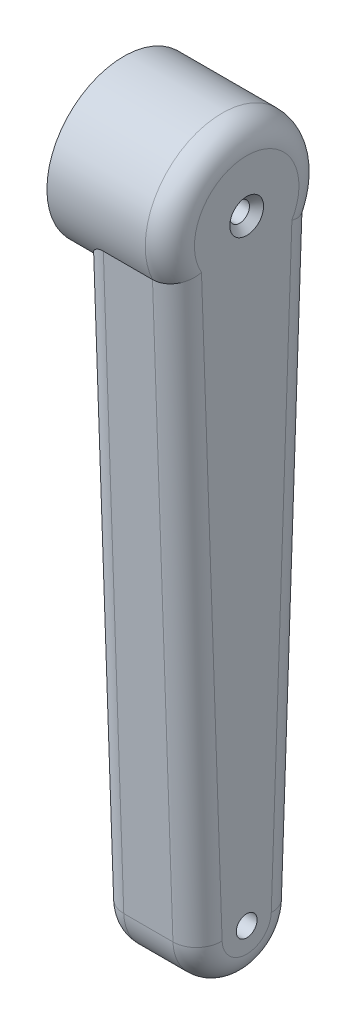
ISO-10303-21;
HEADER;
FILE_DESCRIPTION(('STEP AP214'),'2;1');
FILE_NAME('part.step','',(''),(''),'','','');
FILE_SCHEMA(('AUTOMOTIVE_DESIGN { 1 0 10303 214 1 1 1 1 }'));
ENDSEC;
DATA;
#1=APPLICATION_CONTEXT('core data for automotive mechanical design processes');
#2=APPLICATION_PROTOCOL_DEFINITION('international standard','automotive_design',2000,#1);
#3=PRODUCT_CONTEXT('',#1,'mechanical');
#4=PRODUCT('Part','Part','',(#3));
#5=PRODUCT_RELATED_PRODUCT_CATEGORY('part','',(#4));
#6=PRODUCT_DEFINITION_FORMATION('','',#4);
#7=PRODUCT_DEFINITION_CONTEXT('part definition',#1,'design');
#8=PRODUCT_DEFINITION('design','',#6,#7);
#9=PRODUCT_DEFINITION_SHAPE('','',#8);
#10=(LENGTH_UNIT() NAMED_UNIT(*) SI_UNIT(.MILLI.,.METRE.));
#11=(NAMED_UNIT(*) PLANE_ANGLE_UNIT() SI_UNIT($,.RADIAN.));
#12=(NAMED_UNIT(*) SI_UNIT($,.STERADIAN.) SOLID_ANGLE_UNIT());
#13=UNCERTAINTY_MEASURE_WITH_UNIT(LENGTH_MEASURE(1.E-05),#10,'distance_accuracy_value','');
#14=(GEOMETRIC_REPRESENTATION_CONTEXT(3) GLOBAL_UNCERTAINTY_ASSIGNED_CONTEXT((#13)) GLOBAL_UNIT_ASSIGNED_CONTEXT((#10,
#11,#12)) REPRESENTATION_CONTEXT('',''));
#15=CARTESIAN_POINT('',(0.,0.,0.));
#16=DIRECTION('',(0.,0.,1.));
#17=DIRECTION('',(1.,0.,0.));
#18=AXIS2_PLACEMENT_3D('',#15,#16,#17);
#19=CARTESIAN_POINT('',(16.,-100.,0.));
#20=DIRECTION('',(-1.,0.,0.));
#21=DIRECTION('',(0.,0.,1.));
#22=AXIS2_PLACEMENT_3D('',#19,#20,#21);
#23=PLANE('',#22);
#24=CARTESIAN_POINT('',(16.,0.,0.));
#25=DIRECTION('',(-1.,0.,0.));
#26=DIRECTION('',(0.,0.,1.));
#27=AXIS2_PLACEMENT_3D('',#24,#25,#26);
#28=CIRCLE('',#27,8.5);
#29=CARTESIAN_POINT('',(16.,-4.26004924922759,-7.35540484230171));
#30=VERTEX_POINT('',#29);
#31=CARTESIAN_POINT('',(16.,-4.26004924922762,7.35540484230169));
#32=VERTEX_POINT('',#31);
#33=EDGE_CURVE('E145',#30,#32,#28,.F.);
#34=ORIENTED_EDGE('',*,*,#33,.T.);
#35=DIRECTION('',(0.,0.999387312306895,0.0349999999999999));
#36=VECTOR('',#35,1.);
#37=CARTESIAN_POINT('',(16.,-100.14,3.99754924922757));
#38=LINE('',#37,#36);
#39=CARTESIAN_POINT('',(16.,-100.14,3.99754924922757));
#40=VERTEX_POINT('',#39);
#41=EDGE_CURVE('E149',#32,#40,#38,.F.);
#42=ORIENTED_EDGE('',*,*,#41,.T.);
#43=CARTESIAN_POINT('',(16.,-100.,0.));
#44=DIRECTION('',(-1.,0.,0.));
#45=DIRECTION('',(0.,0.,1.));
#46=AXIS2_PLACEMENT_3D('',#43,#44,#45);
#47=CIRCLE('',#46,4.);
#48=CARTESIAN_POINT('',(16.,-100.14,-3.99754924922759));
#49=VERTEX_POINT('',#48);
#50=EDGE_CURVE('E147',#40,#49,#47,.F.);
#51=ORIENTED_EDGE('',*,*,#50,.T.);
#52=DIRECTION('',(0.,-0.999387312306895,0.0349999999999999));
#53=VECTOR('',#52,1.);
#54=CARTESIAN_POINT('',(16.,-5.15847794112679,-7.32394056030689));
#55=LINE('',#54,#53);
#56=EDGE_CURVE('E143',#49,#30,#55,.F.);
#57=ORIENTED_EDGE('',*,*,#56,.T.);
#58=EDGE_LOOP('',(#34,#42,#51,#57));
#59=FACE_BOUND('',#58,.T.);
#60=CARTESIAN_POINT('',(16.,-100.,0.));
#61=DIRECTION('',(1.,0.,0.));
#62=DIRECTION('',(0.,0.,-1.));
#63=AXIS2_PLACEMENT_3D('',#60,#61,#62);
#64=CIRCLE('',#63,1.69999999999999);
#65=CARTESIAN_POINT('',(16.,-100.,-1.70000000000001));
#66=VERTEX_POINT('',#65);
#67=EDGE_CURVE('E217',#66,#66,#64,.T.);
#68=ORIENTED_EDGE('',*,*,#67,.F.);
#69=EDGE_LOOP('',(#68));
#70=FACE_BOUND('',#69,.T.);
#71=CARTESIAN_POINT('',(16.,0.,0.));
#72=DIRECTION('',(1.,0.,0.));
#73=DIRECTION('',(0.,0.,-1.));
#74=AXIS2_PLACEMENT_3D('',#71,#72,#73);
#75=CIRCLE('',#74,2.75);
#76=CARTESIAN_POINT('',(16.,0.,-2.75));
#77=VERTEX_POINT('',#76);
#78=EDGE_CURVE('E244',#77,#77,#75,.T.);
#79=ORIENTED_EDGE('',*,*,#78,.F.);
#80=EDGE_LOOP('',(#79));
#81=FACE_BOUND('',#80,.T.);
#82=ADVANCED_FACE('F39',(#59,#70,#81),#23,.F.);
#83=CARTESIAN_POINT('',(16.,-100.,0.));
#84=DIRECTION('',(-1.,0.,0.));
#85=DIRECTION('',(0.,0.,1.));
#86=AXIS2_PLACEMENT_3D('',#83,#84,#85);
#87=CYLINDRICAL_SURFACE('',#86,8.);
#88=DIRECTION('',(-1.,0.,0.));
#89=VECTOR('',#88,1.);
#90=CARTESIAN_POINT('',(16.,-100.28,7.99509849845515));
#91=LINE('',#90,#89);
#92=CARTESIAN_POINT('',(12.,-100.28,7.99509849845515));
#93=VERTEX_POINT('',#92);
#94=CARTESIAN_POINT('',(4.,-100.28,7.99509849845515));
#95=VERTEX_POINT('',#94);
#96=EDGE_CURVE('E229',#93,#95,#91,.T.);
#97=ORIENTED_EDGE('',*,*,#96,.T.);
#98=CARTESIAN_POINT('',(4.,-100.,0.));
#99=DIRECTION('',(-1.,0.,0.));
#100=DIRECTION('',(0.,0.,1.));
#101=AXIS2_PLACEMENT_3D('',#98,#99,#100);
#102=CIRCLE('',#101,8.);
#103=CARTESIAN_POINT('',(4.,-100.28,-7.99509849845517));
#104=VERTEX_POINT('',#103);
#105=EDGE_CURVE('E132',#95,#104,#102,.F.);
#106=ORIENTED_EDGE('',*,*,#105,.T.);
#107=DIRECTION('',(-1.,0.,0.));
#108=VECTOR('',#107,1.);
#109=CARTESIAN_POINT('',(16.,-100.28,-7.99509849845517));
#110=LINE('',#109,#108);
#111=CARTESIAN_POINT('',(12.,-100.28,-7.99509849845517));
#112=VERTEX_POINT('',#111);
#113=EDGE_CURVE('E231',#112,#104,#110,.T.);
#114=ORIENTED_EDGE('',*,*,#113,.F.);
#115=CARTESIAN_POINT('',(12.,-100.,0.));
#116=DIRECTION('',(-1.,0.,0.));
#117=DIRECTION('',(0.,0.,1.));
#118=AXIS2_PLACEMENT_3D('',#115,#116,#117);
#119=CIRCLE('',#118,8.);
#120=EDGE_CURVE('E129',#112,#93,#119,.T.);
#121=ORIENTED_EDGE('',*,*,#120,.T.);
#122=EDGE_LOOP('',(#97,#106,#114,#121));
#123=FACE_BOUND('',#122,.T.);
#124=ADVANCED_FACE('F180',(#123),#87,.T.);
#125=CARTESIAN_POINT('',(16.,-5.29847794112679,-11.3214898095345));
#126=DIRECTION('',(0.,-0.0349999999999999,-0.999387312306895));
#127=DIRECTION('',(0.,0.999387312306895,-0.0349999999999999));
#128=AXIS2_PLACEMENT_3D('',#125,#126,#127);
#129=PLANE('',#128);
#130=ORIENTED_EDGE('',*,*,#113,.T.);
#131=DIRECTION('',(0.,-0.999387312306895,0.0349999999999999));
#132=VECTOR('',#131,1.);
#133=CARTESIAN_POINT('',(4.,-5.29847794112679,-11.3214898095345));
#134=LINE('',#133,#132);
#135=CARTESIAN_POINT('',(4.,-5.29847794112679,-11.3214898095345));
#136=VERTEX_POINT('',#135);
#137=EDGE_CURVE('E56',#104,#136,#134,.F.);
#138=ORIENTED_EDGE('',*,*,#137,.T.);
#139=DIRECTION('',(-1.,0.,0.));
#140=VECTOR('',#139,1.);
#141=CARTESIAN_POINT('',(16.,-5.29847794112679,-11.3214898095345));
#142=LINE('',#141,#140);
#143=CARTESIAN_POINT('',(12.,-5.29847794112679,-11.3214898095345));
#144=VERTEX_POINT('',#143);
#145=EDGE_CURVE('E111',#144,#136,#142,.T.);
#146=ORIENTED_EDGE('',*,*,#145,.F.);
#147=DIRECTION('',(0.,-0.999387312306895,0.0349999999999999));
#148=VECTOR('',#147,1.);
#149=CARTESIAN_POINT('',(12.,-100.28,-7.99509849845517));
#150=LINE('',#149,#148);
#151=EDGE_CURVE('E152',#144,#112,#150,.T.);
#152=ORIENTED_EDGE('',*,*,#151,.T.);
#153=EDGE_LOOP('',(#130,#138,#146,#152));
#154=FACE_BOUND('',#153,.T.);
#155=ADVANCED_FACE('F174',(#154),#129,.T.);
#156=CARTESIAN_POINT('',(16.,0.,0.));
#157=DIRECTION('',(-1.,0.,0.));
#158=DIRECTION('',(0.,0.,1.));
#159=AXIS2_PLACEMENT_3D('',#156,#157,#158);
#160=CYLINDRICAL_SURFACE('',#159,12.5);
#161=DIRECTION('',(-1.,0.,0.));
#162=VECTOR('',#161,1.);
#163=CARTESIAN_POINT('',(16.,-5.29847794112683,11.3214898095344));
#164=LINE('',#163,#162);
#165=CARTESIAN_POINT('',(12.,-5.29847794112683,11.3214898095344));
#166=VERTEX_POINT('',#165);
#167=CARTESIAN_POINT('',(4.,-5.29847794112683,11.3214898095344));
#168=VERTEX_POINT('',#167);
#169=EDGE_CURVE('E234',#166,#168,#164,.T.);
#170=ORIENTED_EDGE('',*,*,#169,.F.);
#171=CARTESIAN_POINT('',(12.,0.,0.));
#172=DIRECTION('',(-1.,0.,0.));
#173=DIRECTION('',(0.,0.,1.));
#174=AXIS2_PLACEMENT_3D('',#171,#172,#173);
#175=CIRCLE('',#174,12.5);
#176=EDGE_CURVE('E63',#166,#144,#175,.T.);
#177=ORIENTED_EDGE('',*,*,#176,.T.);
#178=ORIENTED_EDGE('',*,*,#145,.T.);
#179=CARTESIAN_POINT('',(4.,-5.29847794112679,-11.3214898095345));
#180=CARTESIAN_POINT('',(3.94827259578191,-5.29844501342563,-11.321501846381));
#181=CARTESIAN_POINT('',(3.89656696703319,-5.30079572383906,-11.3204050474624));
#182=CARTESIAN_POINT('',(3.79374021031847,-5.31000629834465,-11.3160893890076));
#183=CARTESIAN_POINT('',(3.74261818628529,-5.31685790752488,-11.312874414298));
#184=CARTESIAN_POINT('',(3.6421114833302,-5.33467131226439,-11.3044845280791));
#185=CARTESIAN_POINT('',(3.59271210711949,-5.3455661135294,-11.2993415495444));
#186=CARTESIAN_POINT('',(3.495101454552,-5.37107380656171,-11.2872391753606));
#187=CARTESIAN_POINT('',(3.44689079233543,-5.3856885778325,-11.2802788614625));
#188=CARTESIAN_POINT('',(3.27191115544819,-5.44555915207527,-11.2515867315262));
#189=CARTESIAN_POINT('',(3.14941273535164,-5.50100357968462,-11.2247020487472));
#190=CARTESIAN_POINT('',(2.91472992170457,-5.6276274640149,-11.1617575003199));
#191=CARTESIAN_POINT('',(2.80263278497043,-5.69892549511647,-11.1256281664731));
#192=CARTESIAN_POINT('',(2.59338398478274,-5.84761336375433,-11.0481729323011));
#193=CARTESIAN_POINT('',(2.4957714088286,-5.92454087451836,-11.0071834909875));
#194=CARTESIAN_POINT('',(2.30801814991435,-6.0842489266541,-10.9197170545552));
#195=CARTESIAN_POINT('',(2.21788438790958,-6.16703476097216,-10.8732350709092));
#196=CARTESIAN_POINT('',(2.04398213691388,-6.33654138233907,-10.7753349434999));
#197=CARTESIAN_POINT('',(1.96022347760559,-6.42326792940482,-10.7239094430103));
#198=CARTESIAN_POINT('',(1.79844184806451,-6.59924664326761,-10.616524344237));
#199=CARTESIAN_POINT('',(1.72042067497507,-6.68849958938296,-10.5605633367448));
#200=CARTESIAN_POINT('',(1.51352406145531,-6.93550408917516,-10.401135282344));
#201=CARTESIAN_POINT('',(1.38993889182053,-7.09487467875508,-10.2932663731318));
#202=CARTESIAN_POINT('',(1.15707932408039,-7.41517626360612,-10.0649855594774));
#203=CARTESIAN_POINT('',(1.04781346429156,-7.57610812896822,-9.94456624761134));
#204=CARTESIAN_POINT('',(0.843667044363425,-7.89692695478744,-9.69175686926402));
#205=CARTESIAN_POINT('',(0.748752492750532,-8.05681549793047,-9.55939631324617));
#206=CARTESIAN_POINT('',(0.573605964047782,-8.37418229138815,-9.28263944853098));
#207=CARTESIAN_POINT('',(0.493371455039384,-8.53166095304193,-9.13824522158786));
#208=CARTESIAN_POINT('',(0.356026018541589,-8.8272223850927,-8.85257547467984));
#209=CARTESIAN_POINT('',(0.297410558210616,-8.96567915450798,-8.71241233474033));
#210=CARTESIAN_POINT('',(0.194498443726828,-9.23815982172879,-8.42293845075238));
#211=CARTESIAN_POINT('',(0.150194038588486,-9.37218608370382,-8.27363271071539));
#212=CARTESIAN_POINT('',(0.0773853409177179,-9.63533465578342,-7.96564547167313));
#213=CARTESIAN_POINT('',(0.0489586575956671,-9.764430053355,-7.80692204329362));
#214=CARTESIAN_POINT('',(0.0199378440825788,-9.95292974496337,-7.56305456559429));
#215=CARTESIAN_POINT('',(0.0125335100088522,-10.0149685992016,-7.48071156025581));
#216=CARTESIAN_POINT('',(0.00256498604680787,-10.1371430025419,-7.31430104528432));
#217=CARTESIAN_POINT('',(2.30051907135436E-06,-10.1972779543731,-7.23023300786135));
#218=CARTESIAN_POINT('',(0.,-10.256373123069,-7.14540484230172));
#219=B_SPLINE_CURVE_WITH_KNOTS('',3,(#179,#180,#181,#182,#183,#184,#185,#186,#187,#188,#189,
#190,#191,#192,#193,#194,#195,#196,#197,#198,#199,#200,#201,#202,#203,#204,#205,#206,#207,#208,
#209,#210,#211,#212,#213,#214,#215,#216,#217,#218),.UNSPECIFIED.,.F.,.F.,(4,2,2,2,2,2,2,2,2,2,2,
2,2,2,2,2,2,2,2,4),(0.,0.155082242006115,0.309880845245904,0.46222136348192,0.614639004614371,
1.02344443202533,1.43541694827487,1.8274353041856,2.21981248240993,2.61278289538772,
3.00587587812928,3.69105796886063,4.3766467787512,5.06058542063195,5.74440598978428,
6.36036948683349,6.97599881141094,7.59461153003839,7.90457397795546,8.2146327192416),.UNSPECIFIED.);
#220=CARTESIAN_POINT('',(0.,-10.256373123069,-7.14540484230171));
#221=VERTEX_POINT('',#220);
#222=EDGE_CURVE('E48',#136,#221,#219,.T.);
#223=ORIENTED_EDGE('',*,*,#222,.T.);
#224=CARTESIAN_POINT('',(0.,0.,0.));
#225=DIRECTION('',(-1.,0.,0.));
#226=DIRECTION('',(0.,0.,1.));
#227=AXIS2_PLACEMENT_3D('',#224,#225,#226);
#228=CIRCLE('',#227,12.5);
#229=CARTESIAN_POINT('',(0.,-10.256373123069,7.14540484230169));
#230=VERTEX_POINT('',#229);
#231=EDGE_CURVE('E109',#221,#230,#228,.T.);
#232=ORIENTED_EDGE('',*,*,#231,.T.);
#233=CARTESIAN_POINT('',(0.,-10.256373123069,7.14540484230169));
#234=CARTESIAN_POINT('',(1.48088992586517E-05,-10.1591127390292,7.28505420061016));
#235=CARTESIAN_POINT('',(0.0069493827453666,-10.0590188797601,7.42260538980072));
#236=CARTESIAN_POINT('',(0.033442331487322,-9.85406410715736,7.6925898271743));
#237=CARTESIAN_POINT('',(0.0529842545742357,-9.74920957174455,7.82502950719416));
#238=CARTESIAN_POINT('',(0.103398997411206,-9.53572948380426,8.08380846336634));
#239=CARTESIAN_POINT('',(0.134234144090184,-9.42711754410229,8.21016645972691));
#240=CARTESIAN_POINT('',(0.206226540758285,-9.20645592503249,8.45686506282257));
#241=CARTESIAN_POINT('',(0.247388404929576,-9.09440472863182,8.57720295074776));
#242=CARTESIAN_POINT('',(0.354195613764617,-8.83034794937605,8.84996241798845));
#243=CARTESIAN_POINT('',(0.423443318210629,-8.67729042842654,8.9999635520502));
#244=CARTESIAN_POINT('',(0.576972950784283,-8.36782100829896,9.28839821503496));
#245=CARTESIAN_POINT('',(0.661259698638109,-8.21140804794645,9.42682801461903));
#246=CARTESIAN_POINT('',(0.844018783460349,-7.89650326639474,9.69214667664076));
#247=CARTESIAN_POINT('',(0.942517899264185,-7.7380080460527,9.81901299798096));
#248=CARTESIAN_POINT('',(1.15320764101636,-7.42104136165481,10.0607058407361));
#249=CARTESIAN_POINT('',(1.26539174543324,-7.26256992203696,10.1755380488351));
#250=CARTESIAN_POINT('',(1.4523936810609,-7.01606382575777,10.3458512349467));
#251=CARTESIAN_POINT('',(1.5223792027844,-6.92721780990178,10.4055158524718));
#252=CARTESIAN_POINT('',(1.66723643814451,-6.75088685807732,10.520770313472));
#253=CARTESIAN_POINT('',(1.74210728032984,-6.66340168278923,10.5763608799468));
#254=CARTESIAN_POINT('',(1.89705435449014,-6.49070279311527,10.6832142681378));
#255=CARTESIAN_POINT('',(1.97712213448289,-6.40548569335688,10.7344838198533));
#256=CARTESIAN_POINT('',(2.14319217746378,-6.23832266002673,10.8324842179177));
#257=CARTESIAN_POINT('',(2.2291922952254,-6.15637556071715,10.8792166903809));
#258=CARTESIAN_POINT('',(2.42851071996636,-5.97910922410671,10.9778285757797));
#259=CARTESIAN_POINT('',(2.54357715072934,-5.88502076719282,11.0284388932673));
#260=CARTESIAN_POINT('',(2.78624805584459,-5.70900013125793,11.1205719093206));
#261=CARTESIAN_POINT('',(2.91383931480911,-5.62705536339433,11.1621040403778));
#262=CARTESIAN_POINT('',(3.13966847919622,-5.5070790540867,11.2216328571995));
#263=CARTESIAN_POINT('',(3.23400520203349,-5.46342490839016,11.2428940287869));
#264=CARTESIAN_POINT('',(3.42883396643222,-5.38951743204673,11.2785100679163));
#265=CARTESIAN_POINT('',(3.52929913020478,-5.35920978802468,11.292892947511));
#266=CARTESIAN_POINT('',(3.69209331643651,-5.32478418142662,11.3091502950881));
#267=CARTESIAN_POINT('',(3.75297527562082,-5.3150179125738,11.3137382896379));
#268=CARTESIAN_POINT('',(3.87587840059066,-5.30182013142728,11.3199257879206));
#269=CARTESIAN_POINT('',(3.93790378733766,-5.29842111279699,11.321509962913));
#270=CARTESIAN_POINT('',(4.,-5.29847794112683,11.3214898095344));
#271=B_SPLINE_CURVE_WITH_KNOTS('',3,(#233,#234,#235,#236,#237,#238,#239,#240,#241,#242,#243,
#244,#245,#246,#247,#248,#249,#250,#251,#252,#253,#254,#255,#256,#257,#258,#259,#260,#261,#262,
#263,#264,#265,#266,#267,#268,#269,#270),.UNSPECIFIED.,.F.,.F.,(4,2,2,2,2,2,2,2,2,2,2,2,2,2,2,2,
2,2,4),(0.,0.510218255248357,1.0197720503614,1.52764128105405,2.03573784321106,2.71046258277723,
3.38540394840371,4.06163405510145,4.73754315655492,5.12102549130347,5.50443960588783,
5.88724506890041,6.26991282187166,6.74014194768056,7.20988014489047,7.52726782077508,
7.84335167977679,8.02846395633235,8.21451836021238),.UNSPECIFIED.);
#272=EDGE_CURVE('E11',#230,#168,#271,.T.);
#273=ORIENTED_EDGE('',*,*,#272,.T.);
#274=EDGE_LOOP('',(#170,#177,#178,#223,#232,#273));
#275=FACE_BOUND('',#274,.T.);
#276=CARTESIAN_POINT('',(-4.,0.,0.));
#277=DIRECTION('',(-1.,0.,0.));
#278=DIRECTION('',(0.,0.,1.));
#279=AXIS2_PLACEMENT_3D('',#276,#277,#278);
#280=CIRCLE('',#279,12.5);
#281=CARTESIAN_POINT('',(-4.,0.,12.5));
#282=VERTEX_POINT('',#281);
#283=EDGE_CURVE('E122',#282,#282,#280,.T.);
#284=ORIENTED_EDGE('',*,*,#283,.F.);
#285=EDGE_LOOP('',(#284));
#286=FACE_BOUND('',#285,.T.);
#287=ADVANCED_FACE('F107',(#275,#286),#160,.T.);
#288=CARTESIAN_POINT('',(16.,-100.28,7.99509849845515));
#289=DIRECTION('',(0.,-0.0349999999999999,0.999387312306895));
#290=DIRECTION('',(0.,-0.999387312306895,-0.0349999999999999));
#291=AXIS2_PLACEMENT_3D('',#288,#289,#290);
#292=PLANE('',#291);
#293=ORIENTED_EDGE('',*,*,#96,.F.);
#294=DIRECTION('',(0.,0.999387312306895,0.0349999999999999));
#295=VECTOR('',#294,1.);
#296=CARTESIAN_POINT('',(12.,-5.29847794112681,11.3214898095345));
#297=LINE('',#296,#295);
#298=EDGE_CURVE('E140',#93,#166,#297,.T.);
#299=ORIENTED_EDGE('',*,*,#298,.T.);
#300=ORIENTED_EDGE('',*,*,#169,.T.);
#301=DIRECTION('',(0.,0.999387312306895,0.0349999999999999));
#302=VECTOR('',#301,1.);
#303=CARTESIAN_POINT('',(4.,-100.28,7.99509849845515));
#304=LINE('',#303,#302);
#305=EDGE_CURVE('E138',#168,#95,#304,.F.);
#306=ORIENTED_EDGE('',*,*,#305,.T.);
#307=EDGE_LOOP('',(#293,#299,#300,#306));
#308=FACE_BOUND('',#307,.T.);
#309=ADVANCED_FACE('F173',(#308),#292,.T.);
#310=CARTESIAN_POINT('',(0.,-100.,0.));
#311=DIRECTION('',(-1.,0.,0.));
#312=DIRECTION('',(0.,0.,1.));
#313=AXIS2_PLACEMENT_3D('',#310,#311,#312);
#314=PLANE('',#313);
#315=CARTESIAN_POINT('',(0.,-100.,0.));
#316=DIRECTION('',(-1.,0.,0.));
#317=DIRECTION('',(0.,0.,1.));
#318=AXIS2_PLACEMENT_3D('',#315,#316,#317);
#319=CIRCLE('',#318,1.69999999999999);
#320=CARTESIAN_POINT('',(0.,-100.,1.69999999999998));
#321=VERTEX_POINT('',#320);
#322=EDGE_CURVE('E214',#321,#321,#319,.T.);
#323=ORIENTED_EDGE('',*,*,#322,.F.);
#324=EDGE_LOOP('',(#323));
#325=FACE_BOUND('',#324,.T.);
#326=ORIENTED_EDGE('',*,*,#231,.F.);
#327=DIRECTION('',(0.,-0.999387312306895,0.0349999999999999));
#328=VECTOR('',#327,1.);
#329=CARTESIAN_POINT('',(0.,-100.14,-3.99754924922759));
#330=LINE('',#329,#328);
#331=CARTESIAN_POINT('',(0.,-100.14,-3.99754924922759));
#332=VERTEX_POINT('',#331);
#333=EDGE_CURVE('E118',#221,#332,#330,.T.);
#334=ORIENTED_EDGE('',*,*,#333,.T.);
#335=CARTESIAN_POINT('',(0.,-100.,0.));
#336=DIRECTION('',(-1.,0.,0.));
#337=DIRECTION('',(0.,0.,1.));
#338=AXIS2_PLACEMENT_3D('',#335,#336,#337);
#339=CIRCLE('',#338,4.);
#340=CARTESIAN_POINT('',(0.,-100.14,3.99754924922757));
#341=VERTEX_POINT('',#340);
#342=EDGE_CURVE('E130',#332,#341,#339,.T.);
#343=ORIENTED_EDGE('',*,*,#342,.T.);
#344=DIRECTION('',(0.,0.999387312306895,0.0349999999999999));
#345=VECTOR('',#344,1.);
#346=CARTESIAN_POINT('',(0.,-100.14,3.99754924922757));
#347=LINE('',#346,#345);
#348=EDGE_CURVE('E121',#341,#230,#347,.T.);
#349=ORIENTED_EDGE('',*,*,#348,.T.);
#350=EDGE_LOOP('',(#326,#334,#343,#349));
#351=FACE_BOUND('',#350,.T.);
#352=ADVANCED_FACE('F116',(#325,#351),#314,.T.);
#353=CARTESIAN_POINT('',(-4.,0.,0.));
#354=DIRECTION('',(-1.,0.,0.));
#355=DIRECTION('',(0.,0.,1.));
#356=AXIS2_PLACEMENT_3D('',#353,#354,#355);
#357=PLANE('',#356);
#358=CARTESIAN_POINT('',(-4.,0.,0.));
#359=DIRECTION('',(-1.,0.,0.));
#360=DIRECTION('',(0.,0.,1.));
#361=AXIS2_PLACEMENT_3D('',#358,#359,#360);
#362=CIRCLE('',#361,10.7);
#363=CARTESIAN_POINT('',(-4.,0.,10.7));
#364=VERTEX_POINT('',#363);
#365=EDGE_CURVE('E123',#364,#364,#362,.T.);
#366=ORIENTED_EDGE('',*,*,#365,.F.);
#367=EDGE_LOOP('',(#366));
#368=FACE_BOUND('',#367,.T.);
#369=ORIENTED_EDGE('',*,*,#283,.T.);
#370=EDGE_LOOP('',(#369));
#371=FACE_BOUND('',#370,.T.);
#372=ADVANCED_FACE('F204',(#368,#371),#357,.T.);
#373=CARTESIAN_POINT('',(16.,0.,0.));
#374=DIRECTION('',(-1.,0.,0.));
#375=DIRECTION('',(0.,0.,1.));
#376=AXIS2_PLACEMENT_3D('',#373,#374,#375);
#377=CYLINDRICAL_SURFACE('',#376,10.7);
#378=CARTESIAN_POINT('',(-1.5,0.,0.));
#379=DIRECTION('',(-1.,0.,0.));
#380=DIRECTION('',(0.,0.,1.));
#381=AXIS2_PLACEMENT_3D('',#378,#379,#380);
#382=CIRCLE('',#381,10.7);
#383=CARTESIAN_POINT('',(-1.5,0.,10.7));
#384=VERTEX_POINT('',#383);
#385=EDGE_CURVE('E216',#384,#384,#382,.T.);
#386=ORIENTED_EDGE('',*,*,#385,.F.);
#387=EDGE_LOOP('',(#386));
#388=FACE_BOUND('',#387,.T.);
#389=ORIENTED_EDGE('',*,*,#365,.T.);
#390=EDGE_LOOP('',(#389));
#391=FACE_BOUND('',#390,.T.);
#392=ADVANCED_FACE('F210',(#388,#391),#377,.F.);
#393=CARTESIAN_POINT('',(-1.5,10.7,0.));
#394=DIRECTION('',(1.,0.,0.));
#395=DIRECTION('',(0.,0.,-1.));
#396=AXIS2_PLACEMENT_3D('',#393,#394,#395);
#397=PLANE('',#396);
#398=CARTESIAN_POINT('',(-1.5,0.,0.));
#399=DIRECTION('',(1.,0.,0.));
#400=DIRECTION('',(0.,0.,-1.));
#401=AXIS2_PLACEMENT_3D('',#398,#399,#400);
#402=CIRCLE('',#401,1.59999999999999);
#403=CARTESIAN_POINT('',(-1.5,0.,-1.59999999999999));
#404=VERTEX_POINT('',#403);
#405=EDGE_CURVE('E222',#404,#404,#402,.T.);
#406=ORIENTED_EDGE('',*,*,#405,.T.);
#407=EDGE_LOOP('',(#406));
#408=FACE_BOUND('',#407,.T.);
#409=ORIENTED_EDGE('',*,*,#385,.T.);
#410=EDGE_LOOP('',(#409));
#411=FACE_BOUND('',#410,.T.);
#412=ADVANCED_FACE('F327',(#408,#411),#397,.F.);
#413=CARTESIAN_POINT('',(16.,-100.,0.));
#414=DIRECTION('',(1.,0.,0.));
#415=DIRECTION('',(0.,0.,-1.));
#416=AXIS2_PLACEMENT_3D('',#413,#414,#415);
#417=CYLINDRICAL_SURFACE('',#416,1.69999999999999);
#418=ORIENTED_EDGE('',*,*,#322,.T.);
#419=EDGE_LOOP('',(#418));
#420=FACE_BOUND('',#419,.T.);
#421=ORIENTED_EDGE('',*,*,#67,.T.);
#422=EDGE_LOOP('',(#421));
#423=FACE_BOUND('',#422,.T.);
#424=ADVANCED_FACE('F320',(#420,#423),#417,.F.);
#425=CARTESIAN_POINT('',(16.,0.,0.));
#426=DIRECTION('',(1.,0.,0.));
#427=DIRECTION('',(0.,0.,-1.));
#428=AXIS2_PLACEMENT_3D('',#425,#426,#427);
#429=CYLINDRICAL_SURFACE('',#428,1.59999999999999);
#430=CARTESIAN_POINT('',(14.85,0.,0.));
#431=DIRECTION('',(1.,0.,0.));
#432=DIRECTION('',(0.,0.,-1.));
#433=AXIS2_PLACEMENT_3D('',#430,#431,#432);
#434=CIRCLE('',#433,1.59999999999999);
#435=CARTESIAN_POINT('',(14.85,0.,-1.59999999999999));
#436=VERTEX_POINT('',#435);
#437=EDGE_CURVE('E240',#436,#436,#434,.T.);
#438=ORIENTED_EDGE('',*,*,#437,.T.);
#439=EDGE_LOOP('',(#438));
#440=FACE_BOUND('',#439,.T.);
#441=ORIENTED_EDGE('',*,*,#405,.F.);
#442=EDGE_LOOP('',(#441));
#443=FACE_BOUND('',#442,.T.);
#444=ADVANCED_FACE('F312',(#440,#443),#429,.F.);
#445=CARTESIAN_POINT('',(16.,0.,0.));
#446=DIRECTION('',(1.,0.,0.));
#447=DIRECTION('',(0.,0.,-1.));
#448=AXIS2_PLACEMENT_3D('',#445,#446,#447);
#449=CONICAL_SURFACE('',#448,2.75,0.785398163397453);
#450=ORIENTED_EDGE('',*,*,#437,.F.);
#451=EDGE_LOOP('',(#450));
#452=FACE_BOUND('',#451,.T.);
#453=ORIENTED_EDGE('',*,*,#78,.T.);
#454=EDGE_LOOP('',(#453));
#455=FACE_BOUND('',#454,.T.);
#456=ADVANCED_FACE('F195',(#452,#455),#449,.F.);
#457=CARTESIAN_POINT('',(4.,-100.14,-3.99754924922759));
#458=DIRECTION('',(0.,-0.999387312306895,0.0349999999999999));
#459=DIRECTION('',(0.,-0.0349999999999999,-0.999387312306895));
#460=AXIS2_PLACEMENT_3D('',#457,#458,#459);
#461=CYLINDRICAL_SURFACE('',#460,4.);
#462=ORIENTED_EDGE('',*,*,#222,.F.);
#463=ORIENTED_EDGE('',*,*,#137,.F.);
#464=CARTESIAN_POINT('',(4.,-100.14,-3.99754924922759));
#465=DIRECTION('',(0.,-0.999387312306895,0.0350000000000003));
#466=DIRECTION('',(0.,-0.0350000000000003,-0.999387312306895));
#467=AXIS2_PLACEMENT_3D('',#464,#465,#466);
#468=CIRCLE('',#467,4.);
#469=EDGE_CURVE('E127',#332,#104,#468,.T.);
#470=ORIENTED_EDGE('',*,*,#469,.F.);
#471=ORIENTED_EDGE('',*,*,#333,.F.);
#472=EDGE_LOOP('',(#462,#463,#470,#471));
#473=FACE_BOUND('',#472,.T.);
#474=ADVANCED_FACE('F125',(#473),#461,.T.);
#475=CARTESIAN_POINT('',(4.,-100.14,3.99754924922757));
#476=DIRECTION('',(0.,0.999387312306895,0.0349999999999999));
#477=DIRECTION('',(0.,-0.0349999999999999,0.999387312306895));
#478=AXIS2_PLACEMENT_3D('',#475,#476,#477);
#479=CYLINDRICAL_SURFACE('',#478,4.);
#480=ORIENTED_EDGE('',*,*,#272,.F.);
#481=ORIENTED_EDGE('',*,*,#348,.F.);
#482=CARTESIAN_POINT('',(4.,-100.14,3.99754924922757));
#483=DIRECTION('',(0.,-0.999387312306895,-0.0350000000000003));
#484=DIRECTION('',(0.,0.0350000000000003,-0.999387312306895));
#485=AXIS2_PLACEMENT_3D('',#482,#483,#484);
#486=CIRCLE('',#485,4.);
#487=EDGE_CURVE('E251',#95,#341,#486,.T.);
#488=ORIENTED_EDGE('',*,*,#487,.F.);
#489=ORIENTED_EDGE('',*,*,#305,.F.);
#490=EDGE_LOOP('',(#480,#481,#488,#489));
#491=FACE_BOUND('',#490,.T.);
#492=ADVANCED_FACE('F187',(#491),#479,.T.);
#493=CARTESIAN_POINT('',(4.,-100.,0.));
#494=DIRECTION('',(-1.,0.,0.));
#495=DIRECTION('',(0.,0.,1.));
#496=AXIS2_PLACEMENT_3D('',#493,#494,#495);
#497=DEGENERATE_TOROIDAL_SURFACE('',#496,4.,4.,.T.);
#498=ORIENTED_EDGE('',*,*,#469,.T.);
#499=ORIENTED_EDGE('',*,*,#105,.F.);
#500=ORIENTED_EDGE('',*,*,#487,.T.);
#501=ORIENTED_EDGE('',*,*,#342,.F.);
#502=EDGE_LOOP('',(#498,#499,#500,#501));
#503=FACE_BOUND('',#502,.T.);
#504=ADVANCED_FACE('F184',(#503),#497,.T.);
#505=CARTESIAN_POINT('',(12.,-5.15847794112679,-7.32394056030689));
#506=DIRECTION('',(0.,0.999387312306895,-0.0349999999999999));
#507=DIRECTION('',(0.,0.0349999999999999,0.999387312306895));
#508=AXIS2_PLACEMENT_3D('',#505,#506,#507);
#509=CYLINDRICAL_SURFACE('',#508,4.);
#510=CARTESIAN_POINT('',(12.,-5.29847794112679,-11.3214898095345));
#511=CARTESIAN_POINT('',(12.110769362346,-5.29847992402344,-11.3215028539994));
#512=CARTESIAN_POINT('',(12.2215360880985,-5.29737834691496,-11.3169248259367));
#513=CARTESIAN_POINT('',(12.4422660726989,-5.29298261447221,-11.2986816970372));
#514=CARTESIAN_POINT('',(12.5522293969602,-5.28968863970172,-11.2850173445415));
#515=CARTESIAN_POINT('',(12.7704422182754,-5.28092789539991,-11.248718346602));
#516=CARTESIAN_POINT('',(12.8786936091094,-5.27546373125123,-11.2260944574656));
#517=CARTESIAN_POINT('',(13.0928460787989,-5.26239133269686,-11.1720630866001));
#518=CARTESIAN_POINT('',(13.1987471711387,-5.25478311059558,-11.1406556552782));
#519=CARTESIAN_POINT('',(13.4074734289228,-5.23745829781029,-11.0692951819094));
#520=CARTESIAN_POINT('',(13.5102982391677,-5.22774146471883,-11.0293411573473));
#521=CARTESIAN_POINT('',(13.7121520018051,-5.20625041095275,-10.9412122674507));
#522=CARTESIAN_POINT('',(13.8111795388135,-5.19447543204824,-10.8930343725601));
#523=CARTESIAN_POINT('',(14.101424627106,-5.1561540345837,-10.7367358369941));
#524=CARTESIAN_POINT('',(14.2860481909339,-5.12659097983571,-10.6167666547535));
#525=CARTESIAN_POINT('',(14.6335995031565,-5.05979182348706,-10.348046777102));
#526=CARTESIAN_POINT('',(14.7963474765623,-5.02249787177855,-10.1990796349767));
#527=CARTESIAN_POINT('',(15.0944061954708,-4.94108749422479,-9.87735248411507));
#528=CARTESIAN_POINT('',(15.2297087265357,-4.89696903274305,-9.70458537793791));
#529=CARTESIAN_POINT('',(15.4717867343606,-4.8018746460556,-9.33682940945648));
#530=CARTESIAN_POINT('',(15.5779634259926,-4.75078313959717,-9.14147702957861));
#531=CARTESIAN_POINT('',(15.7557654165514,-4.64343863162598,-8.73699283183677));
#532=CARTESIAN_POINT('',(15.8274024681522,-4.58718739356126,-8.52786572861545));
#533=CARTESIAN_POINT('',(15.9199122349581,-4.48673952816008,-8.16045896719063));
#534=CARTESIAN_POINT('',(15.9493256368876,-4.44347864135009,-8.0040004839892));
#535=CARTESIAN_POINT('',(15.98897524375,-4.35536517844843,-7.68930994587919));
#536=CARTESIAN_POINT('',(15.9992460309323,-4.3105156220973,-7.53108160976892));
#537=CARTESIAN_POINT('',(15.9999867000939,-4.26344542066717,-7.36721892302173));
#538=CARTESIAN_POINT('',(16.0000000347317,-4.2617476931096,-7.3613116575412));
#539=CARTESIAN_POINT('',(16.,-4.26004924922759,-7.35540484230171));
#540=B_SPLINE_CURVE_WITH_KNOTS('',3,(#510,#511,#512,#513,#514,#515,#516,#517,#518,#519,#520,
#521,#522,#523,#524,#525,#526,#527,#528,#529,#530,#531,#532,#533,#534,#535,#536,#537,#538,#539),
.UNSPECIFIED.,.F.,.F.,(4,2,2,2,2,2,2,2,2,2,2,2,2,2,4),(0.,0.332204078084046,0.664380799540968,
0.996159931711792,1.32793715989363,1.65975254965254,1.99169044029382,2.65480097106171,
3.3230652808946,3.99152930848044,4.67285138632014,5.35394146934926,5.84784874983603,
6.34086288990039,6.35930202236633),.UNSPECIFIED.);
#541=EDGE_CURVE('E271',#30,#144,#540,.F.);
#542=ORIENTED_EDGE('',*,*,#541,.F.);
#543=ORIENTED_EDGE('',*,*,#56,.F.);
#544=CARTESIAN_POINT('',(12.,-100.14,-3.99754924922759));
#545=DIRECTION('',(0.,-0.999387312306895,0.0350000000000003));
#546=DIRECTION('',(0.,-0.0350000000000003,-0.999387312306895));
#547=AXIS2_PLACEMENT_3D('',#544,#545,#546);
#548=CIRCLE('',#547,4.);
#549=EDGE_CURVE('E43',#112,#49,#548,.T.);
#550=ORIENTED_EDGE('',*,*,#549,.F.);
#551=ORIENTED_EDGE('',*,*,#151,.F.);
#552=EDGE_LOOP('',(#542,#543,#550,#551));
#553=FACE_BOUND('',#552,.T.);
#554=ADVANCED_FACE('F186',(#553),#509,.T.);
#555=CARTESIAN_POINT('',(12.,-100.,0.));
#556=DIRECTION('',(-1.,0.,0.));
#557=DIRECTION('',(0.,0.,1.));
#558=AXIS2_PLACEMENT_3D('',#555,#556,#557);
#559=DEGENERATE_TOROIDAL_SURFACE('',#558,4.,4.,.T.);
#560=ORIENTED_EDGE('',*,*,#549,.T.);
#561=ORIENTED_EDGE('',*,*,#50,.F.);
#562=CARTESIAN_POINT('',(12.,-100.14,3.99754924922757));
#563=DIRECTION('',(0.,0.999387312306895,0.0350000000000003));
#564=DIRECTION('',(0.,-0.0350000000000003,0.999387312306895));
#565=AXIS2_PLACEMENT_3D('',#562,#563,#564);
#566=CIRCLE('',#565,4.);
#567=EDGE_CURVE('E262',#93,#40,#566,.T.);
#568=ORIENTED_EDGE('',*,*,#567,.F.);
#569=ORIENTED_EDGE('',*,*,#120,.F.);
#570=EDGE_LOOP('',(#560,#561,#568,#569));
#571=FACE_BOUND('',#570,.T.);
#572=ADVANCED_FACE('F41',(#571),#559,.T.);
#573=CARTESIAN_POINT('',(12.,0.,0.));
#574=DIRECTION('',(-1.,0.,0.));
#575=DIRECTION('',(0.,0.,1.));
#576=AXIS2_PLACEMENT_3D('',#573,#574,#575);
#577=TOROIDAL_SURFACE('',#576,8.5,4.);
#578=ORIENTED_EDGE('',*,*,#541,.T.);
#579=ORIENTED_EDGE('',*,*,#176,.F.);
#580=CARTESIAN_POINT('',(12.,-5.29847794112683,11.3214898095344));
#581=CARTESIAN_POINT('',(12.110769362346,-5.29847992402348,11.3215028539994));
#582=CARTESIAN_POINT('',(12.2215360880985,-5.297378346915,11.3169248259367));
#583=CARTESIAN_POINT('',(12.4422660726989,-5.29298261447225,11.2986816970372));
#584=CARTESIAN_POINT('',(12.5522293969602,-5.28968863970177,11.2850173445415));
#585=CARTESIAN_POINT('',(12.7704422182754,-5.28092789539995,11.2487183466019));
#586=CARTESIAN_POINT('',(12.8786936091094,-5.27546373125126,11.2260944574656));
#587=CARTESIAN_POINT('',(13.0928460787989,-5.26239133269689,11.1720630866));
#588=CARTESIAN_POINT('',(13.1987471711387,-5.25478311059562,11.1406556552782));
#589=CARTESIAN_POINT('',(13.4074734289228,-5.23745829781034,11.0692951819093));
#590=CARTESIAN_POINT('',(13.5102982391677,-5.22774146471887,11.0293411573472));
#591=CARTESIAN_POINT('',(13.7121520018051,-5.20625041095278,10.9412122674506));
#592=CARTESIAN_POINT('',(13.8111795388135,-5.19447543204827,10.8930343725601));
#593=CARTESIAN_POINT('',(14.101424627106,-5.15615403458375,10.736735836994));
#594=CARTESIAN_POINT('',(14.2860481909339,-5.12659097983575,10.6167666547535));
#595=CARTESIAN_POINT('',(14.6335995031565,-5.05979182348709,10.3480467771019));
#596=CARTESIAN_POINT('',(14.7963474765623,-5.02249787177859,10.1990796349767));
#597=CARTESIAN_POINT('',(15.0944061954708,-4.94108749422482,9.87735248411506));
#598=CARTESIAN_POINT('',(15.2297087265357,-4.89696903274306,9.7045853779379));
#599=CARTESIAN_POINT('',(15.4717867343606,-4.80187464605565,9.33682940945645));
#600=CARTESIAN_POINT('',(15.5779634259926,-4.75078313959729,9.14147702957856));
#601=CARTESIAN_POINT('',(15.7557654165514,-4.64343863162595,8.73699283183677));
#602=CARTESIAN_POINT('',(15.8274024681522,-4.58718739356101,8.52786572861551));
#603=CARTESIAN_POINT('',(15.9199122349581,-4.48673952816032,8.16045896719057));
#604=CARTESIAN_POINT('',(15.9493256368876,-4.44347864135079,8.00400048398902));
#605=CARTESIAN_POINT('',(15.98897524375,-4.3553651784478,7.6893099458794));
#606=CARTESIAN_POINT('',(15.9992460309323,-4.31051562209487,7.53108160976966));
#607=CARTESIAN_POINT('',(15.9999867000939,-4.26344542066705,7.3672189230218));
#608=CARTESIAN_POINT('',(16.0000000347317,-4.26174769310956,7.36131165754125));
#609=CARTESIAN_POINT('',(16.,-4.26004924922765,7.35540484230174));
#610=B_SPLINE_CURVE_WITH_KNOTS('',3,(#580,#581,#582,#583,#584,#585,#586,#587,#588,#589,#590,
#591,#592,#593,#594,#595,#596,#597,#598,#599,#600,#601,#602,#603,#604,#605,#606,#607,#608,#609),
.UNSPECIFIED.,.F.,.F.,(4,2,2,2,2,2,2,2,2,2,2,2,2,2,4),(0.,0.332204078084044,0.664380799540966,
0.996159931711792,1.32793715989363,1.65975254965254,1.99169044029382,2.65480097106171,
3.32306528089459,3.99152930848043,4.67285138632015,5.35394146934926,5.84784874983599,
6.34086288990035,6.35930202236628),.UNSPECIFIED.);
#611=EDGE_CURVE('E255',#32,#166,#610,.F.);
#612=ORIENTED_EDGE('',*,*,#611,.F.);
#613=ORIENTED_EDGE('',*,*,#33,.F.);
#614=EDGE_LOOP('',(#578,#579,#612,#613));
#615=FACE_BOUND('',#614,.T.);
#616=ADVANCED_FACE('F265',(#615),#577,.T.);
#617=CARTESIAN_POINT('',(12.,-100.14,3.99754924922757));
#618=DIRECTION('',(0.,-0.999387312306895,-0.0349999999999999));
#619=DIRECTION('',(0.,0.0349999999999999,-0.999387312306895));
#620=AXIS2_PLACEMENT_3D('',#617,#618,#619);
#621=CYLINDRICAL_SURFACE('',#620,4.);
#622=ORIENTED_EDGE('',*,*,#567,.T.);
#623=ORIENTED_EDGE('',*,*,#41,.F.);
#624=ORIENTED_EDGE('',*,*,#611,.T.);
#625=ORIENTED_EDGE('',*,*,#298,.F.);
#626=EDGE_LOOP('',(#622,#623,#624,#625));
#627=FACE_BOUND('',#626,.T.);
#628=ADVANCED_FACE('F263',(#627),#621,.T.);
#629=CLOSED_SHELL('',(#82,#124,#155,#287,#309,#352,#372,#392,#412,#424,#444,#456,#474,#492,#504,
#554,#572,#616,#628));
#630=MANIFOLD_SOLID_BREP('B2',#629);
#631=ADVANCED_BREP_SHAPE_REPRESENTATION('',(#18,#630),#14);
#632=SHAPE_DEFINITION_REPRESENTATION(#9,#631);
ENDSEC;
END-ISO-10303-21;
